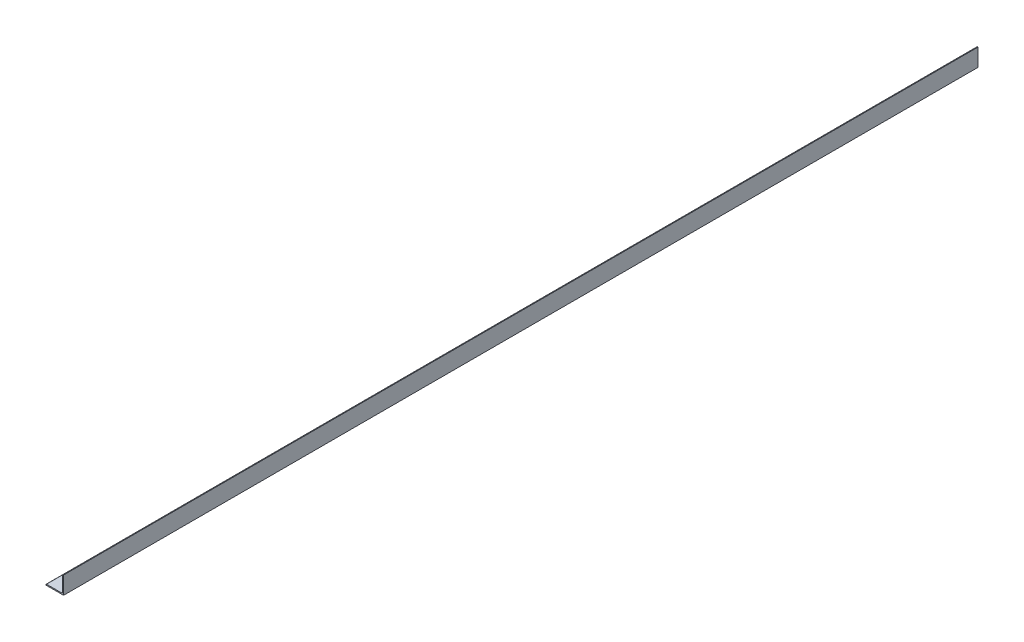
ISO-10303-21;
HEADER;
FILE_DESCRIPTION(('STEP AP214'),'2;1');
FILE_NAME('part.step','',(''),(''),'','','');
FILE_SCHEMA(('AUTOMOTIVE_DESIGN { 1 0 10303 214 1 1 1 1 }'));
ENDSEC;
DATA;
#1=APPLICATION_CONTEXT('core data for automotive mechanical design processes');
#2=APPLICATION_PROTOCOL_DEFINITION('international standard','automotive_design',2000,#1);
#3=PRODUCT_CONTEXT('',#1,'mechanical');
#4=PRODUCT('Part','Part','',(#3));
#5=PRODUCT_RELATED_PRODUCT_CATEGORY('part','',(#4));
#6=PRODUCT_DEFINITION_FORMATION('','',#4);
#7=PRODUCT_DEFINITION_CONTEXT('part definition',#1,'design');
#8=PRODUCT_DEFINITION('design','',#6,#7);
#9=PRODUCT_DEFINITION_SHAPE('','',#8);
#10=(LENGTH_UNIT() NAMED_UNIT(*) SI_UNIT(.MILLI.,.METRE.));
#11=(NAMED_UNIT(*) PLANE_ANGLE_UNIT() SI_UNIT($,.RADIAN.));
#12=(NAMED_UNIT(*) SI_UNIT($,.STERADIAN.) SOLID_ANGLE_UNIT());
#13=UNCERTAINTY_MEASURE_WITH_UNIT(LENGTH_MEASURE(1.E-05),#10,'distance_accuracy_value','');
#14=(GEOMETRIC_REPRESENTATION_CONTEXT(3) GLOBAL_UNCERTAINTY_ASSIGNED_CONTEXT((#13)) GLOBAL_UNIT_ASSIGNED_CONTEXT((#10,
#11,#12)) REPRESENTATION_CONTEXT('',''));
#15=CARTESIAN_POINT('',(0.,0.,0.));
#16=DIRECTION('',(0.,0.,1.));
#17=DIRECTION('',(1.,0.,0.));
#18=AXIS2_PLACEMENT_3D('',#15,#16,#17);
#19=CARTESIAN_POINT('',(-12.7,-11.90625,660.4));
#20=DIRECTION('',(1.,0.,0.));
#21=DIRECTION('',(0.,0.,-1.));
#22=AXIS2_PLACEMENT_3D('',#19,#20,#21);
#23=PLANE('',#22);
#24=DIRECTION('',(0.,-1.,0.));
#25=VECTOR('',#24,1.);
#26=CARTESIAN_POINT('',(-12.7,-11.90625,-660.4));
#27=LINE('',#26,#25);
#28=CARTESIAN_POINT('',(-12.7,-11.90625,-660.4));
#29=VERTEX_POINT('',#28);
#30=CARTESIAN_POINT('',(-12.7,-12.7,-660.4));
#31=VERTEX_POINT('',#30);
#32=EDGE_CURVE('E151',#29,#31,#27,.T.);
#33=ORIENTED_EDGE('',*,*,#32,.T.);
#34=DIRECTION('',(0.,0.,-1.));
#35=VECTOR('',#34,1.);
#36=CARTESIAN_POINT('',(-12.7,-12.7,660.4));
#37=LINE('',#36,#35);
#38=CARTESIAN_POINT('',(-12.7,-12.7,660.4));
#39=VERTEX_POINT('',#38);
#40=EDGE_CURVE('E11',#39,#31,#37,.T.);
#41=ORIENTED_EDGE('',*,*,#40,.F.);
#42=DIRECTION('',(0.,-1.,0.));
#43=VECTOR('',#42,1.);
#44=CARTESIAN_POINT('',(-12.7,-11.90625,660.4));
#45=LINE('',#44,#43);
#46=CARTESIAN_POINT('',(-12.7,-11.90625,660.4));
#47=VERTEX_POINT('',#46);
#48=EDGE_CURVE('E176',#47,#39,#45,.T.);
#49=ORIENTED_EDGE('',*,*,#48,.F.);
#50=DIRECTION('',(0.,0.,-1.));
#51=VECTOR('',#50,1.);
#52=CARTESIAN_POINT('',(-12.7,-11.90625,660.4));
#53=LINE('',#52,#51);
#54=EDGE_CURVE('E147',#47,#29,#53,.T.);
#55=ORIENTED_EDGE('',*,*,#54,.T.);
#56=EDGE_LOOP('',(#33,#41,#49,#55));
#57=FACE_BOUND('',#56,.T.);
#58=ADVANCED_FACE('F44',(#57),#23,.F.);
#59=CARTESIAN_POINT('',(-12.7,-12.7,660.4));
#60=DIRECTION('',(0.,1.,0.));
#61=DIRECTION('',(-1.,0.,0.));
#62=AXIS2_PLACEMENT_3D('',#59,#60,#61);
#63=PLANE('',#62);
#64=DIRECTION('',(1.,0.,0.));
#65=VECTOR('',#64,1.);
#66=CARTESIAN_POINT('',(-12.7,-12.7,-660.4));
#67=LINE('',#66,#65);
#68=CARTESIAN_POINT('',(12.7,-12.7,-660.4));
#69=VERTEX_POINT('',#68);
#70=EDGE_CURVE('E155',#31,#69,#67,.T.);
#71=ORIENTED_EDGE('',*,*,#70,.T.);
#72=DIRECTION('',(0.,0.,-1.));
#73=VECTOR('',#72,1.);
#74=CARTESIAN_POINT('',(12.7,-12.7,660.4));
#75=LINE('',#74,#73);
#76=CARTESIAN_POINT('',(12.7,-12.7,660.4));
#77=VERTEX_POINT('',#76);
#78=EDGE_CURVE('E53',#77,#69,#75,.T.);
#79=ORIENTED_EDGE('',*,*,#78,.F.);
#80=DIRECTION('',(1.,0.,0.));
#81=VECTOR('',#80,1.);
#82=CARTESIAN_POINT('',(-12.7,-12.7,660.4));
#83=LINE('',#82,#81);
#84=EDGE_CURVE('E107',#39,#77,#83,.T.);
#85=ORIENTED_EDGE('',*,*,#84,.F.);
#86=ORIENTED_EDGE('',*,*,#40,.T.);
#87=EDGE_LOOP('',(#71,#79,#85,#86));
#88=FACE_BOUND('',#87,.T.);
#89=ADVANCED_FACE('F232',(#88),#63,.F.);
#90=CARTESIAN_POINT('',(12.7,-12.7,660.4));
#91=DIRECTION('',(-1.,0.,0.));
#92=DIRECTION('',(0.,-1.,0.));
#93=AXIS2_PLACEMENT_3D('',#90,#91,#92);
#94=PLANE('',#93);
#95=DIRECTION('',(0.,1.,0.));
#96=VECTOR('',#95,1.);
#97=CARTESIAN_POINT('',(12.7,-12.7,-660.4));
#98=LINE('',#97,#96);
#99=CARTESIAN_POINT('',(12.7,12.7,-660.4));
#100=VERTEX_POINT('',#99);
#101=EDGE_CURVE('E158',#69,#100,#98,.T.);
#102=ORIENTED_EDGE('',*,*,#101,.T.);
#103=DIRECTION('',(0.,0.,-1.));
#104=VECTOR('',#103,1.);
#105=CARTESIAN_POINT('',(12.7,12.7,660.4));
#106=LINE('',#105,#104);
#107=CARTESIAN_POINT('',(12.7,12.7,660.4));
#108=VERTEX_POINT('',#107);
#109=EDGE_CURVE('E191',#108,#100,#106,.T.);
#110=ORIENTED_EDGE('',*,*,#109,.F.);
#111=DIRECTION('',(0.,1.,0.));
#112=VECTOR('',#111,1.);
#113=CARTESIAN_POINT('',(12.7,-12.7,660.4));
#114=LINE('',#113,#112);
#115=EDGE_CURVE('E201',#77,#108,#114,.T.);
#116=ORIENTED_EDGE('',*,*,#115,.F.);
#117=ORIENTED_EDGE('',*,*,#78,.T.);
#118=EDGE_LOOP('',(#102,#110,#116,#117));
#119=FACE_BOUND('',#118,.T.);
#120=ADVANCED_FACE('F199',(#119),#94,.F.);
#121=CARTESIAN_POINT('',(11.90625,12.7,660.4));
#122=DIRECTION('',(0.,-1.,0.));
#123=DIRECTION('',(0.,0.,-1.));
#124=AXIS2_PLACEMENT_3D('',#121,#122,#123);
#125=PLANE('',#124);
#126=DIRECTION('',(-1.,0.,0.));
#127=VECTOR('',#126,1.);
#128=CARTESIAN_POINT('',(11.90625,12.7,-660.4));
#129=LINE('',#128,#127);
#130=CARTESIAN_POINT('',(11.90625,12.7,-660.4));
#131=VERTEX_POINT('',#130);
#132=EDGE_CURVE('E161',#100,#131,#129,.T.);
#133=ORIENTED_EDGE('',*,*,#132,.T.);
#134=DIRECTION('',(0.,0.,-1.));
#135=VECTOR('',#134,1.);
#136=CARTESIAN_POINT('',(11.90625,12.7,660.4));
#137=LINE('',#136,#135);
#138=CARTESIAN_POINT('',(11.90625,12.7,660.4));
#139=VERTEX_POINT('',#138);
#140=EDGE_CURVE('E187',#139,#131,#137,.T.);
#141=ORIENTED_EDGE('',*,*,#140,.F.);
#142=DIRECTION('',(-1.,0.,0.));
#143=VECTOR('',#142,1.);
#144=CARTESIAN_POINT('',(11.90625,12.7,660.4));
#145=LINE('',#144,#143);
#146=EDGE_CURVE('E218',#108,#139,#145,.T.);
#147=ORIENTED_EDGE('',*,*,#146,.F.);
#148=ORIENTED_EDGE('',*,*,#109,.T.);
#149=EDGE_LOOP('',(#133,#141,#147,#148));
#150=FACE_BOUND('',#149,.T.);
#151=ADVANCED_FACE('F210',(#150),#125,.F.);
#152=CARTESIAN_POINT('',(11.90625,11.90625,660.4));
#153=DIRECTION('',(0.,0.,-1.));
#154=DIRECTION('',(-1.,0.,0.));
#155=AXIS2_PLACEMENT_3D('',#152,#153,#154);
#156=CYLINDRICAL_SURFACE('',#155,0.793749999999998);
#157=CARTESIAN_POINT('',(11.90625,11.90625,-660.4));
#158=DIRECTION('',(0.,0.,1.));
#159=DIRECTION('',(-1.,0.,0.));
#160=AXIS2_PLACEMENT_3D('',#157,#158,#159);
#161=CIRCLE('',#160,0.793749999999998);
#162=CARTESIAN_POINT('',(11.1125,11.90625,-660.4));
#163=VERTEX_POINT('',#162);
#164=EDGE_CURVE('E164',#131,#163,#161,.T.);
#165=ORIENTED_EDGE('',*,*,#164,.T.);
#166=DIRECTION('',(0.,0.,-1.));
#167=VECTOR('',#166,1.);
#168=CARTESIAN_POINT('',(11.1125,11.90625,660.4));
#169=LINE('',#168,#167);
#170=CARTESIAN_POINT('',(11.1125,11.90625,660.4));
#171=VERTEX_POINT('',#170);
#172=EDGE_CURVE('E183',#171,#163,#169,.T.);
#173=ORIENTED_EDGE('',*,*,#172,.F.);
#174=CARTESIAN_POINT('',(11.90625,11.90625,660.4));
#175=DIRECTION('',(0.,0.,1.));
#176=DIRECTION('',(-1.,0.,0.));
#177=AXIS2_PLACEMENT_3D('',#174,#175,#176);
#178=CIRCLE('',#177,0.793749999999998);
#179=EDGE_CURVE('E216',#139,#171,#178,.T.);
#180=ORIENTED_EDGE('',*,*,#179,.F.);
#181=ORIENTED_EDGE('',*,*,#140,.T.);
#182=EDGE_LOOP('',(#165,#173,#180,#181));
#183=FACE_BOUND('',#182,.T.);
#184=ADVANCED_FACE('F214',(#183),#156,.T.);
#185=CARTESIAN_POINT('',(11.1125,11.90625,660.4));
#186=DIRECTION('',(1.,0.,0.));
#187=DIRECTION('',(0.,1.,0.));
#188=AXIS2_PLACEMENT_3D('',#185,#186,#187);
#189=PLANE('',#188);
#190=DIRECTION('',(0.,-1.,0.));
#191=VECTOR('',#190,1.);
#192=CARTESIAN_POINT('',(11.1125,11.90625,-660.4));
#193=LINE('',#192,#191);
#194=CARTESIAN_POINT('',(11.1125,-9.5377,-660.4));
#195=VERTEX_POINT('',#194);
#196=EDGE_CURVE('E167',#163,#195,#193,.T.);
#197=ORIENTED_EDGE('',*,*,#196,.T.);
#198=DIRECTION('',(0.,0.,-1.));
#199=VECTOR('',#198,1.);
#200=CARTESIAN_POINT('',(11.1125,-9.5377,660.4));
#201=LINE('',#200,#199);
#202=CARTESIAN_POINT('',(11.1125,-9.5377,660.4));
#203=VERTEX_POINT('',#202);
#204=EDGE_CURVE('E140',#203,#195,#201,.T.);
#205=ORIENTED_EDGE('',*,*,#204,.F.);
#206=DIRECTION('',(0.,-1.,0.));
#207=VECTOR('',#206,1.);
#208=CARTESIAN_POINT('',(11.1125,11.90625,660.4));
#209=LINE('',#208,#207);
#210=EDGE_CURVE('E129',#171,#203,#209,.T.);
#211=ORIENTED_EDGE('',*,*,#210,.F.);
#212=ORIENTED_EDGE('',*,*,#172,.T.);
#213=EDGE_LOOP('',(#197,#205,#211,#212));
#214=FACE_BOUND('',#213,.T.);
#215=ADVANCED_FACE('F244',(#214),#189,.F.);
#216=CARTESIAN_POINT('',(9.5377,-9.5377,660.4));
#217=DIRECTION('',(0.,0.,-1.));
#218=DIRECTION('',(-1.,0.,0.));
#219=AXIS2_PLACEMENT_3D('',#216,#217,#218);
#220=CYLINDRICAL_SURFACE('',#219,1.5748);
#221=CARTESIAN_POINT('',(9.5377,-9.5377,-660.4));
#222=DIRECTION('',(0.,0.,-1.));
#223=DIRECTION('',(-1.,0.,0.));
#224=AXIS2_PLACEMENT_3D('',#221,#222,#223);
#225=CIRCLE('',#224,1.5748);
#226=CARTESIAN_POINT('',(9.5377,-11.1125,-660.4));
#227=VERTEX_POINT('',#226);
#228=EDGE_CURVE('E138',#195,#227,#225,.T.);
#229=ORIENTED_EDGE('',*,*,#228,.T.);
#230=DIRECTION('',(0.,0.,-1.));
#231=VECTOR('',#230,1.);
#232=CARTESIAN_POINT('',(9.5377,-11.1125,660.4));
#233=LINE('',#232,#231);
#234=CARTESIAN_POINT('',(9.5377,-11.1125,660.4));
#235=VERTEX_POINT('',#234);
#236=EDGE_CURVE('E135',#235,#227,#233,.T.);
#237=ORIENTED_EDGE('',*,*,#236,.F.);
#238=CARTESIAN_POINT('',(9.5377,-9.5377,660.4));
#239=DIRECTION('',(0.,0.,-1.));
#240=DIRECTION('',(-1.,0.,0.));
#241=AXIS2_PLACEMENT_3D('',#238,#239,#240);
#242=CIRCLE('',#241,1.5748);
#243=EDGE_CURVE('E123',#203,#235,#242,.T.);
#244=ORIENTED_EDGE('',*,*,#243,.F.);
#245=ORIENTED_EDGE('',*,*,#204,.T.);
#246=EDGE_LOOP('',(#229,#237,#244,#245));
#247=FACE_BOUND('',#246,.T.);
#248=ADVANCED_FACE('F136',(#247),#220,.F.);
#249=CARTESIAN_POINT('',(9.5377,-11.1125,660.4));
#250=DIRECTION('',(0.,-1.,0.));
#251=DIRECTION('',(0.,0.,-1.));
#252=AXIS2_PLACEMENT_3D('',#249,#250,#251);
#253=PLANE('',#252);
#254=DIRECTION('',(-1.,0.,0.));
#255=VECTOR('',#254,1.);
#256=CARTESIAN_POINT('',(9.5377,-11.1125,-660.4));
#257=LINE('',#256,#255);
#258=CARTESIAN_POINT('',(-11.90625,-11.1125,-660.4));
#259=VERTEX_POINT('',#258);
#260=EDGE_CURVE('E93',#227,#259,#257,.T.);
#261=ORIENTED_EDGE('',*,*,#260,.T.);
#262=DIRECTION('',(0.,0.,-1.));
#263=VECTOR('',#262,1.);
#264=CARTESIAN_POINT('',(-11.90625,-11.1125,660.4));
#265=LINE('',#264,#263);
#266=CARTESIAN_POINT('',(-11.90625,-11.1125,660.4));
#267=VERTEX_POINT('',#266);
#268=EDGE_CURVE('E141',#267,#259,#265,.T.);
#269=ORIENTED_EDGE('',*,*,#268,.F.);
#270=DIRECTION('',(-1.,0.,0.));
#271=VECTOR('',#270,1.);
#272=CARTESIAN_POINT('',(9.5377,-11.1125,660.4));
#273=LINE('',#272,#271);
#274=EDGE_CURVE('E127',#235,#267,#273,.T.);
#275=ORIENTED_EDGE('',*,*,#274,.F.);
#276=ORIENTED_EDGE('',*,*,#236,.T.);
#277=EDGE_LOOP('',(#261,#269,#275,#276));
#278=FACE_BOUND('',#277,.T.);
#279=ADVANCED_FACE('F143',(#278),#253,.F.);
#280=CARTESIAN_POINT('',(-11.90625,-11.90625,660.4));
#281=DIRECTION('',(0.,0.,-1.));
#282=DIRECTION('',(-1.,0.,0.));
#283=AXIS2_PLACEMENT_3D('',#280,#281,#282);
#284=CYLINDRICAL_SURFACE('',#283,0.79375);
#285=CARTESIAN_POINT('',(-11.90625,-11.90625,-660.4));
#286=DIRECTION('',(0.,0.,1.));
#287=DIRECTION('',(-1.,0.,0.));
#288=AXIS2_PLACEMENT_3D('',#285,#286,#287);
#289=CIRCLE('',#288,0.79375);
#290=EDGE_CURVE('E99',#259,#29,#289,.T.);
#291=ORIENTED_EDGE('',*,*,#290,.T.);
#292=ORIENTED_EDGE('',*,*,#54,.F.);
#293=CARTESIAN_POINT('',(-11.90625,-11.90625,660.4));
#294=DIRECTION('',(0.,0.,1.));
#295=DIRECTION('',(-1.,0.,0.));
#296=AXIS2_PLACEMENT_3D('',#293,#294,#295);
#297=CIRCLE('',#296,0.79375);
#298=EDGE_CURVE('E61',#267,#47,#297,.T.);
#299=ORIENTED_EDGE('',*,*,#298,.F.);
#300=ORIENTED_EDGE('',*,*,#268,.T.);
#301=EDGE_LOOP('',(#291,#292,#299,#300));
#302=FACE_BOUND('',#301,.T.);
#303=ADVANCED_FACE('F252',(#302),#284,.T.);
#304=CARTESIAN_POINT('',(11.90625,11.90625,660.4));
#305=DIRECTION('',(0.,0.,-1.));
#306=DIRECTION('',(-1.,0.,0.));
#307=AXIS2_PLACEMENT_3D('',#304,#305,#306);
#308=PLANE('',#307);
#309=ORIENTED_EDGE('',*,*,#48,.T.);
#310=ORIENTED_EDGE('',*,*,#84,.T.);
#311=ORIENTED_EDGE('',*,*,#115,.T.);
#312=ORIENTED_EDGE('',*,*,#146,.T.);
#313=ORIENTED_EDGE('',*,*,#179,.T.);
#314=ORIENTED_EDGE('',*,*,#210,.T.);
#315=ORIENTED_EDGE('',*,*,#243,.T.);
#316=ORIENTED_EDGE('',*,*,#274,.T.);
#317=ORIENTED_EDGE('',*,*,#298,.T.);
#318=EDGE_LOOP('',(#309,#310,#311,#312,#313,#314,#315,#316,#317));
#319=FACE_BOUND('',#318,.T.);
#320=ADVANCED_FACE('F125',(#319),#308,.F.);
#321=CARTESIAN_POINT('',(11.90625,11.90625,-660.4));
#322=DIRECTION('',(0.,0.,-1.));
#323=DIRECTION('',(-1.,0.,0.));
#324=AXIS2_PLACEMENT_3D('',#321,#322,#323);
#325=PLANE('',#324);
#326=ORIENTED_EDGE('',*,*,#32,.F.);
#327=ORIENTED_EDGE('',*,*,#290,.F.);
#328=ORIENTED_EDGE('',*,*,#260,.F.);
#329=ORIENTED_EDGE('',*,*,#228,.F.);
#330=ORIENTED_EDGE('',*,*,#196,.F.);
#331=ORIENTED_EDGE('',*,*,#164,.F.);
#332=ORIENTED_EDGE('',*,*,#132,.F.);
#333=ORIENTED_EDGE('',*,*,#101,.F.);
#334=ORIENTED_EDGE('',*,*,#70,.F.);
#335=EDGE_LOOP('',(#326,#327,#328,#329,#330,#331,#332,#333,#334));
#336=FACE_BOUND('',#335,.T.);
#337=ADVANCED_FACE('F205',(#336),#325,.T.);
#338=CLOSED_SHELL('',(#58,#89,#120,#151,#184,#215,#248,#279,#303,#320,#337));
#339=MANIFOLD_SOLID_BREP('B2',#338);
#340=ADVANCED_BREP_SHAPE_REPRESENTATION('',(#18,#339),#14);
#341=SHAPE_DEFINITION_REPRESENTATION(#9,#340);
ENDSEC;
END-ISO-10303-21;
